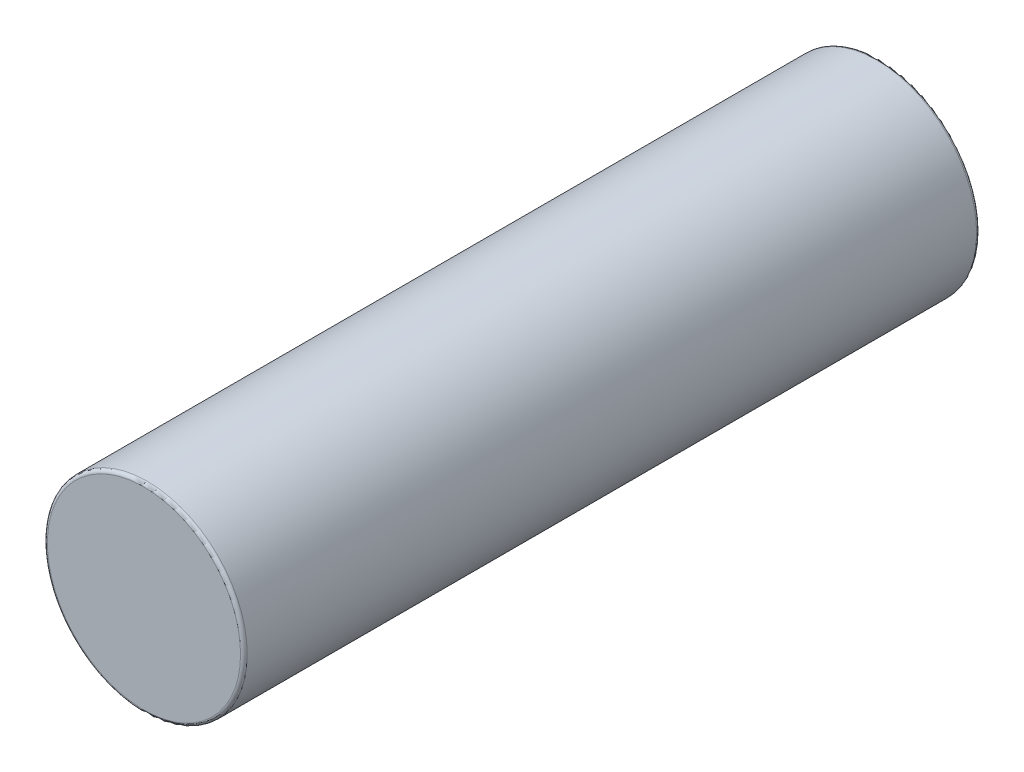
ISO-10303-21;
HEADER;
FILE_DESCRIPTION(('STEP AP214'),'2;1');
FILE_NAME('part.step','',(''),(''),'','','');
FILE_SCHEMA(('AUTOMOTIVE_DESIGN { 1 0 10303 214 1 1 1 1 }'));
ENDSEC;
DATA;
#1=APPLICATION_CONTEXT('core data for automotive mechanical design processes');
#2=APPLICATION_PROTOCOL_DEFINITION('international standard','automotive_design',2000,#1);
#3=PRODUCT_CONTEXT('',#1,'mechanical');
#4=PRODUCT('Part','Part','',(#3));
#5=PRODUCT_RELATED_PRODUCT_CATEGORY('part','',(#4));
#6=PRODUCT_DEFINITION_FORMATION('','',#4);
#7=PRODUCT_DEFINITION_CONTEXT('part definition',#1,'design');
#8=PRODUCT_DEFINITION('design','',#6,#7);
#9=PRODUCT_DEFINITION_SHAPE('','',#8);
#10=(LENGTH_UNIT() NAMED_UNIT(*) SI_UNIT(.MILLI.,.METRE.));
#11=(NAMED_UNIT(*) PLANE_ANGLE_UNIT() SI_UNIT($,.RADIAN.));
#12=(NAMED_UNIT(*) SI_UNIT($,.STERADIAN.) SOLID_ANGLE_UNIT());
#13=UNCERTAINTY_MEASURE_WITH_UNIT(LENGTH_MEASURE(1.E-05),#10,'distance_accuracy_value','');
#14=(GEOMETRIC_REPRESENTATION_CONTEXT(3) GLOBAL_UNCERTAINTY_ASSIGNED_CONTEXT((#13)) GLOBAL_UNIT_ASSIGNED_CONTEXT((#10,
#11,#12)) REPRESENTATION_CONTEXT('',''));
#15=CARTESIAN_POINT('',(0.,0.,0.));
#16=DIRECTION('',(0.,0.,1.));
#17=DIRECTION('',(1.,0.,0.));
#18=AXIS2_PLACEMENT_3D('',#15,#16,#17);
#19=CARTESIAN_POINT('',(0.,0.,55.25));
#20=DIRECTION('',(0.,0.,-1.));
#21=DIRECTION('',(-1.,0.,0.));
#22=AXIS2_PLACEMENT_3D('',#19,#20,#21);
#23=CYLINDRICAL_SURFACE('',#22,7.5);
#24=CARTESIAN_POINT('',(0.,0.,0.25));
#25=DIRECTION('',(0.,0.,1.));
#26=DIRECTION('',(1.,0.,0.));
#27=AXIS2_PLACEMENT_3D('',#24,#25,#26);
#28=CIRCLE('',#27,7.5);
#29=CARTESIAN_POINT('',(7.5,0.,0.25));
#30=VERTEX_POINT('',#29);
#31=EDGE_CURVE('E54',#30,#30,#28,.T.);
#32=ORIENTED_EDGE('',*,*,#31,.T.);
#33=EDGE_LOOP('',(#32));
#34=FACE_BOUND('',#33,.T.);
#35=CARTESIAN_POINT('',(0.,0.,55.));
#36=DIRECTION('',(0.,0.,1.));
#37=DIRECTION('',(1.,0.,0.));
#38=AXIS2_PLACEMENT_3D('',#35,#36,#37);
#39=CIRCLE('',#38,7.5);
#40=CARTESIAN_POINT('',(7.5,0.,55.));
#41=VERTEX_POINT('',#40);
#42=EDGE_CURVE('E59',#41,#41,#39,.F.);
#43=ORIENTED_EDGE('',*,*,#42,.T.);
#44=EDGE_LOOP('',(#43));
#45=FACE_BOUND('',#44,.T.);
#46=ADVANCED_FACE('F41',(#34,#45),#23,.T.);
#47=CARTESIAN_POINT('',(0.,0.,55.25));
#48=DIRECTION('',(0.,0.,1.));
#49=DIRECTION('',(1.,0.,0.));
#50=AXIS2_PLACEMENT_3D('',#47,#48,#49);
#51=PLANE('',#50);
#52=CARTESIAN_POINT('',(0.,0.,55.25));
#53=DIRECTION('',(0.,0.,1.));
#54=DIRECTION('',(1.,0.,0.));
#55=AXIS2_PLACEMENT_3D('',#52,#53,#54);
#56=CIRCLE('',#55,7.25);
#57=CARTESIAN_POINT('',(7.25,0.,55.25));
#58=VERTEX_POINT('',#57);
#59=EDGE_CURVE('E10',#58,#58,#56,.T.);
#60=ORIENTED_EDGE('',*,*,#59,.T.);
#61=EDGE_LOOP('',(#60));
#62=FACE_BOUND('',#61,.T.);
#63=ADVANCED_FACE('F76',(#62),#51,.T.);
#64=CARTESIAN_POINT('',(0.,0.,0.));
#65=DIRECTION('',(0.,0.,1.));
#66=DIRECTION('',(1.,0.,0.));
#67=AXIS2_PLACEMENT_3D('',#64,#65,#66);
#68=PLANE('',#67);
#69=CARTESIAN_POINT('',(0.,0.,0.));
#70=DIRECTION('',(0.,0.,1.));
#71=DIRECTION('',(1.,0.,0.));
#72=AXIS2_PLACEMENT_3D('',#69,#70,#71);
#73=CIRCLE('',#72,7.25);
#74=CARTESIAN_POINT('',(7.25,0.,0.));
#75=VERTEX_POINT('',#74);
#76=EDGE_CURVE('E49',#75,#75,#73,.F.);
#77=ORIENTED_EDGE('',*,*,#76,.T.);
#78=EDGE_LOOP('',(#77));
#79=FACE_BOUND('',#78,.T.);
#80=ADVANCED_FACE('F73',(#79),#68,.F.);
#81=CARTESIAN_POINT('',(0.,0.,0.25));
#82=DIRECTION('',(0.,0.,1.));
#83=DIRECTION('',(1.,0.,0.));
#84=AXIS2_PLACEMENT_3D('',#81,#82,#83);
#85=TOROIDAL_SURFACE('',#84,7.25,0.25);
#86=ORIENTED_EDGE('',*,*,#76,.F.);
#87=EDGE_LOOP('',(#86));
#88=FACE_BOUND('',#87,.T.);
#89=ORIENTED_EDGE('',*,*,#31,.F.);
#90=EDGE_LOOP('',(#89));
#91=FACE_BOUND('',#90,.T.);
#92=ADVANCED_FACE('F69',(#88,#91),#85,.T.);
#93=CARTESIAN_POINT('',(0.,0.,55.));
#94=DIRECTION('',(0.,0.,1.));
#95=DIRECTION('',(1.,0.,0.));
#96=AXIS2_PLACEMENT_3D('',#93,#94,#95);
#97=TOROIDAL_SURFACE('',#96,7.25,0.25);
#98=ORIENTED_EDGE('',*,*,#42,.F.);
#99=EDGE_LOOP('',(#98));
#100=FACE_BOUND('',#99,.T.);
#101=ORIENTED_EDGE('',*,*,#59,.F.);
#102=EDGE_LOOP('',(#101));
#103=FACE_BOUND('',#102,.T.);
#104=ADVANCED_FACE('F43',(#100,#103),#97,.T.);
#105=CLOSED_SHELL('',(#46,#63,#80,#92,#104));
#106=MANIFOLD_SOLID_BREP('B2',#105);
#107=ADVANCED_BREP_SHAPE_REPRESENTATION('',(#18,#106),#14);
#108=SHAPE_DEFINITION_REPRESENTATION(#9,#107);
ENDSEC;
END-ISO-10303-21;
